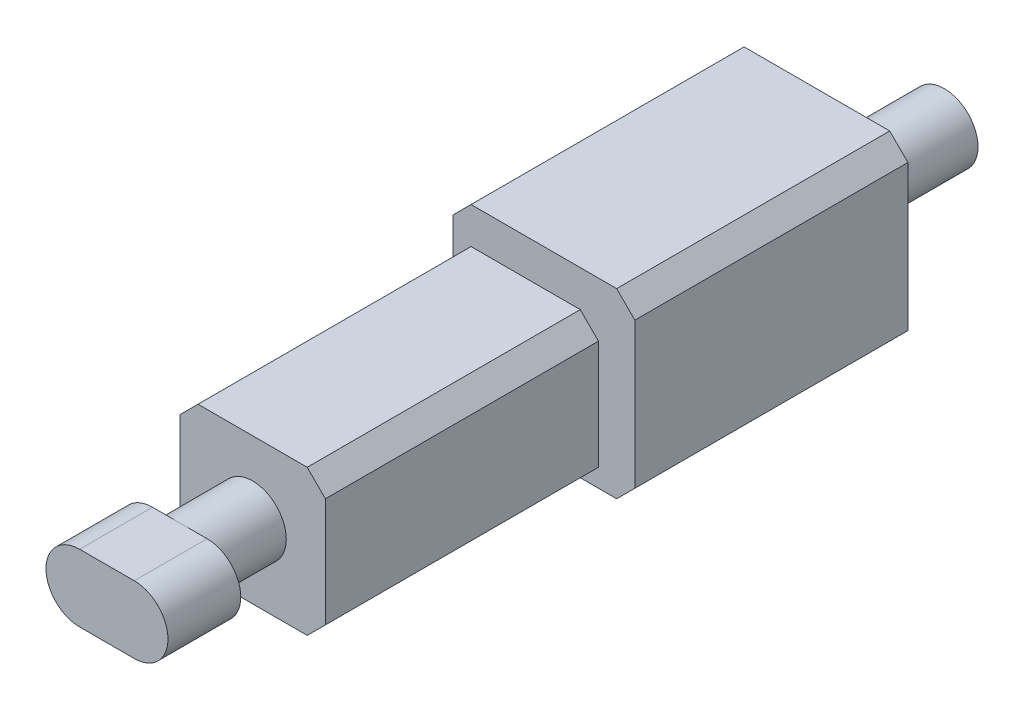
ISO-10303-21;
HEADER;
FILE_DESCRIPTION(('STEP AP214'),'2;1');
FILE_NAME('part.step','',(''),(''),'','','');
FILE_SCHEMA(('AUTOMOTIVE_DESIGN { 1 0 10303 214 1 1 1 1 }'));
ENDSEC;
DATA;
#1=APPLICATION_CONTEXT('core data for automotive mechanical design processes');
#2=APPLICATION_PROTOCOL_DEFINITION('international standard','automotive_design',2000,#1);
#3=PRODUCT_CONTEXT('',#1,'mechanical');
#4=PRODUCT('Part','Part','',(#3));
#5=PRODUCT_RELATED_PRODUCT_CATEGORY('part','',(#4));
#6=PRODUCT_DEFINITION_FORMATION('','',#4);
#7=PRODUCT_DEFINITION_CONTEXT('part definition',#1,'design');
#8=PRODUCT_DEFINITION('design','',#6,#7);
#9=PRODUCT_DEFINITION_SHAPE('','',#8);
#10=(LENGTH_UNIT() NAMED_UNIT(*) SI_UNIT(.MILLI.,.METRE.));
#11=(NAMED_UNIT(*) PLANE_ANGLE_UNIT() SI_UNIT($,.RADIAN.));
#12=(NAMED_UNIT(*) SI_UNIT($,.STERADIAN.) SOLID_ANGLE_UNIT());
#13=UNCERTAINTY_MEASURE_WITH_UNIT(LENGTH_MEASURE(1.E-05),#10,'distance_accuracy_value','');
#14=(GEOMETRIC_REPRESENTATION_CONTEXT(3) GLOBAL_UNCERTAINTY_ASSIGNED_CONTEXT((#13)) GLOBAL_UNIT_ASSIGNED_CONTEXT((#10,
#11,#12)) REPRESENTATION_CONTEXT('',''));
#15=CARTESIAN_POINT('',(0.,0.,0.));
#16=DIRECTION('',(0.,0.,1.));
#17=DIRECTION('',(1.,0.,0.));
#18=AXIS2_PLACEMENT_3D('',#15,#16,#17);
#19=CARTESIAN_POINT('',(2.,4.,7.5));
#20=DIRECTION('',(-1.,0.,0.));
#21=DIRECTION('',(0.,0.,1.));
#22=AXIS2_PLACEMENT_3D('',#19,#20,#21);
#23=PLANE('',#22);
#24=DIRECTION('',(0.,-1.,0.));
#25=VECTOR('',#24,1.);
#26=CARTESIAN_POINT('',(2.,4.,7.5));
#27=LINE('',#26,#25);
#28=CARTESIAN_POINT('',(2.,3.5,7.5));
#29=VERTEX_POINT('',#28);
#30=CARTESIAN_POINT('',(2.,0.5,7.5));
#31=VERTEX_POINT('',#30);
#32=EDGE_CURVE('E217',#29,#31,#27,.T.);
#33=ORIENTED_EDGE('',*,*,#32,.T.);
#34=DIRECTION('',(0.,0.,-1.));
#35=VECTOR('',#34,1.);
#36=CARTESIAN_POINT('',(2.,0.5,0.));
#37=LINE('',#36,#35);
#38=CARTESIAN_POINT('',(2.,0.5,0.));
#39=VERTEX_POINT('',#38);
#40=EDGE_CURVE('E281',#31,#39,#37,.T.);
#41=ORIENTED_EDGE('',*,*,#40,.T.);
#42=DIRECTION('',(0.,-1.,0.));
#43=VECTOR('',#42,1.);
#44=CARTESIAN_POINT('',(2.,4.,0.));
#45=LINE('',#44,#43);
#46=CARTESIAN_POINT('',(2.,3.5,0.));
#47=VERTEX_POINT('',#46);
#48=EDGE_CURVE('E293',#47,#39,#45,.T.);
#49=ORIENTED_EDGE('',*,*,#48,.F.);
#50=DIRECTION('',(0.,0.,1.));
#51=VECTOR('',#50,1.);
#52=CARTESIAN_POINT('',(2.,3.5,7.5));
#53=LINE('',#52,#51);
#54=EDGE_CURVE('E279',#47,#29,#53,.T.);
#55=ORIENTED_EDGE('',*,*,#54,.T.);
#56=EDGE_LOOP('',(#33,#41,#49,#55));
#57=FACE_BOUND('',#56,.T.);
#58=ADVANCED_FACE('F39',(#57),#23,.F.);
#59=CARTESIAN_POINT('',(0.,4.,0.));
#60=DIRECTION('',(0.,-1.,0.));
#61=DIRECTION('',(0.,0.,-1.));
#62=AXIS2_PLACEMENT_3D('',#59,#60,#61);
#63=PLANE('',#62);
#64=DIRECTION('',(1.,0.,0.));
#65=VECTOR('',#64,1.);
#66=CARTESIAN_POINT('',(0.,4.,0.));
#67=LINE('',#66,#65);
#68=CARTESIAN_POINT('',(-1.5,4.,0.));
#69=VERTEX_POINT('',#68);
#70=CARTESIAN_POINT('',(1.5,4.,0.));
#71=VERTEX_POINT('',#70);
#72=EDGE_CURVE('E339',#69,#71,#67,.T.);
#73=ORIENTED_EDGE('',*,*,#72,.F.);
#74=DIRECTION('',(0.,0.,1.));
#75=VECTOR('',#74,1.);
#76=CARTESIAN_POINT('',(-1.5,4.,0.));
#77=LINE('',#76,#75);
#78=CARTESIAN_POINT('',(-1.5,4.,7.5));
#79=VERTEX_POINT('',#78);
#80=EDGE_CURVE('E277',#69,#79,#77,.T.);
#81=ORIENTED_EDGE('',*,*,#80,.T.);
#82=DIRECTION('',(1.,0.,0.));
#83=VECTOR('',#82,1.);
#84=CARTESIAN_POINT('',(-2.,4.,7.5));
#85=LINE('',#84,#83);
#86=CARTESIAN_POINT('',(1.5,4.,7.5));
#87=VERTEX_POINT('',#86);
#88=EDGE_CURVE('E215',#79,#87,#85,.T.);
#89=ORIENTED_EDGE('',*,*,#88,.T.);
#90=DIRECTION('',(0.,0.,-1.));
#91=VECTOR('',#90,1.);
#92=CARTESIAN_POINT('',(1.5,4.,0.));
#93=LINE('',#92,#91);
#94=EDGE_CURVE('E274',#87,#71,#93,.T.);
#95=ORIENTED_EDGE('',*,*,#94,.T.);
#96=EDGE_LOOP('',(#73,#81,#89,#95));
#97=FACE_BOUND('',#96,.T.);
#98=ADVANCED_FACE('F379',(#97),#63,.F.);
#99=CARTESIAN_POINT('',(-2.,4.,-7.5));
#100=DIRECTION('',(0.,0.,1.));
#101=DIRECTION('',(1.,0.,0.));
#102=AXIS2_PLACEMENT_3D('',#99,#100,#101);
#103=PLANE('',#102);
#104=CARTESIAN_POINT('',(1.,2.83290341310044,-7.5));
#105=DIRECTION('',(0.,0.,1.));
#106=DIRECTION('',(1.,0.,0.));
#107=AXIS2_PLACEMENT_3D('',#104,#105,#106);
#108=CIRCLE('',#107,0.925);
#109=CARTESIAN_POINT('',(1.925,2.83290341310044,-7.5));
#110=VERTEX_POINT('',#109);
#111=EDGE_CURVE('E435',#110,#110,#108,.T.);
#112=ORIENTED_EDGE('',*,*,#111,.T.);
#113=EDGE_LOOP('',(#112));
#114=FACE_BOUND('',#113,.T.);
#115=DIRECTION('',(0.,1.,0.));
#116=VECTOR('',#115,1.);
#117=CARTESIAN_POINT('',(3.,0.,-7.5));
#118=LINE('',#117,#116);
#119=CARTESIAN_POINT('',(3.,0.5,-7.5));
#120=VERTEX_POINT('',#119);
#121=CARTESIAN_POINT('',(3.,4.5,-7.5));
#122=VERTEX_POINT('',#121);
#123=EDGE_CURVE('E331',#120,#122,#118,.T.);
#124=ORIENTED_EDGE('',*,*,#123,.F.);
#125=DIRECTION('',(0.707106781186545,0.70710678118655,0.));
#126=VECTOR('',#125,1.);
#127=CARTESIAN_POINT('',(2.5,0.,-7.5));
#128=LINE('',#127,#126);
#129=CARTESIAN_POINT('',(2.5,0.,-7.5));
#130=VERTEX_POINT('',#129);
#131=EDGE_CURVE('E253',#120,#130,#128,.F.);
#132=ORIENTED_EDGE('',*,*,#131,.T.);
#133=DIRECTION('',(-1.,0.,0.));
#134=VECTOR('',#133,1.);
#135=CARTESIAN_POINT('',(-2.,0.,-7.5));
#136=LINE('',#135,#134);
#137=CARTESIAN_POINT('',(-1.5,0.,-7.5));
#138=VERTEX_POINT('',#137);
#139=EDGE_CURVE('E209',#130,#138,#136,.T.);
#140=ORIENTED_EDGE('',*,*,#139,.T.);
#141=DIRECTION('',(-0.70710678118655,0.707106781186545,0.));
#142=VECTOR('',#141,1.);
#143=CARTESIAN_POINT('',(-2.,0.5,-7.5));
#144=LINE('',#143,#142);
#145=CARTESIAN_POINT('',(-2.,0.5,-7.5));
#146=VERTEX_POINT('',#145);
#147=EDGE_CURVE('E247',#138,#146,#144,.T.);
#148=ORIENTED_EDGE('',*,*,#147,.T.);
#149=DIRECTION('',(0.,-1.,0.));
#150=VECTOR('',#149,1.);
#151=CARTESIAN_POINT('',(-2.,4.,-7.5));
#152=LINE('',#151,#150);
#153=CARTESIAN_POINT('',(-2.,4.5,-7.5));
#154=VERTEX_POINT('',#153);
#155=EDGE_CURVE('E214',#154,#146,#152,.T.);
#156=ORIENTED_EDGE('',*,*,#155,.F.);
#157=DIRECTION('',(0.707106781186545,0.70710678118655,0.));
#158=VECTOR('',#157,1.);
#159=CARTESIAN_POINT('',(-1.5,5.,-7.5));
#160=LINE('',#159,#158);
#161=CARTESIAN_POINT('',(-1.5,5.,-7.5));
#162=VERTEX_POINT('',#161);
#163=EDGE_CURVE('E249',#154,#162,#160,.T.);
#164=ORIENTED_EDGE('',*,*,#163,.T.);
#165=DIRECTION('',(-1.,0.,0.));
#166=VECTOR('',#165,1.);
#167=CARTESIAN_POINT('',(-2.,5.,-7.5));
#168=LINE('',#167,#166);
#169=CARTESIAN_POINT('',(2.5,5.,-7.5));
#170=VERTEX_POINT('',#169);
#171=EDGE_CURVE('E329',#170,#162,#168,.T.);
#172=ORIENTED_EDGE('',*,*,#171,.F.);
#173=DIRECTION('',(-0.70710678118655,0.707106781186545,0.));
#174=VECTOR('',#173,1.);
#175=CARTESIAN_POINT('',(3.,4.5,-7.5));
#176=LINE('',#175,#174);
#177=EDGE_CURVE('E251',#170,#122,#176,.F.);
#178=ORIENTED_EDGE('',*,*,#177,.T.);
#179=EDGE_LOOP('',(#124,#132,#140,#148,#156,#164,#172,#178));
#180=FACE_BOUND('',#179,.T.);
#181=ADVANCED_FACE('F317',(#114,#180),#103,.F.);
#182=CARTESIAN_POINT('',(-2.,4.,7.5));
#183=DIRECTION('',(1.,0.,0.));
#184=DIRECTION('',(0.,0.,-1.));
#185=AXIS2_PLACEMENT_3D('',#182,#183,#184);
#186=PLANE('',#185);
#187=DIRECTION('',(0.,-1.,0.));
#188=VECTOR('',#187,1.);
#189=CARTESIAN_POINT('',(-2.,0.,0.));
#190=LINE('',#189,#188);
#191=CARTESIAN_POINT('',(-2.,4.5,0.));
#192=VERTEX_POINT('',#191);
#193=CARTESIAN_POINT('',(-2.,3.5,0.));
#194=VERTEX_POINT('',#193);
#195=EDGE_CURVE('E434',#192,#194,#190,.T.);
#196=ORIENTED_EDGE('',*,*,#195,.F.);
#197=DIRECTION('',(0.,0.,-1.));
#198=VECTOR('',#197,1.);
#199=CARTESIAN_POINT('',(-2.,4.5,-7.5));
#200=LINE('',#199,#198);
#201=EDGE_CURVE('E266',#192,#154,#200,.T.);
#202=ORIENTED_EDGE('',*,*,#201,.T.);
#203=ORIENTED_EDGE('',*,*,#155,.T.);
#204=DIRECTION('',(0.,0.,1.));
#205=VECTOR('',#204,1.);
#206=CARTESIAN_POINT('',(-2.,0.5,7.5));
#207=LINE('',#206,#205);
#208=CARTESIAN_POINT('',(-2.,0.5,7.5));
#209=VERTEX_POINT('',#208);
#210=EDGE_CURVE('E263',#146,#209,#207,.T.);
#211=ORIENTED_EDGE('',*,*,#210,.T.);
#212=DIRECTION('',(0.,-1.,0.));
#213=VECTOR('',#212,1.);
#214=CARTESIAN_POINT('',(-2.,4.,7.5));
#215=LINE('',#214,#213);
#216=CARTESIAN_POINT('',(-2.,3.5,7.5));
#217=VERTEX_POINT('',#216);
#218=EDGE_CURVE('E225',#217,#209,#215,.T.);
#219=ORIENTED_EDGE('',*,*,#218,.F.);
#220=DIRECTION('',(0.,0.,-1.));
#221=VECTOR('',#220,1.);
#222=CARTESIAN_POINT('',(-2.,3.5,7.5));
#223=LINE('',#222,#221);
#224=EDGE_CURVE('E260',#217,#194,#223,.T.);
#225=ORIENTED_EDGE('',*,*,#224,.T.);
#226=EDGE_LOOP('',(#196,#202,#203,#211,#219,#225));
#227=FACE_BOUND('',#226,.T.);
#228=ADVANCED_FACE('F311',(#227),#186,.F.);
#229=CARTESIAN_POINT('',(-2.,4.,7.5));
#230=DIRECTION('',(0.,0.,-1.));
#231=DIRECTION('',(-1.,0.,0.));
#232=AXIS2_PLACEMENT_3D('',#229,#230,#231);
#233=PLANE('',#232);
#234=CARTESIAN_POINT('',(0.,2.,7.5));
#235=DIRECTION('',(0.,0.,1.));
#236=DIRECTION('',(1.,0.,0.));
#237=AXIS2_PLACEMENT_3D('',#234,#235,#236);
#238=CIRCLE('',#237,0.925);
#239=CARTESIAN_POINT('',(0.925,2.,7.5));
#240=VERTEX_POINT('',#239);
#241=EDGE_CURVE('E210',#240,#240,#238,.T.);
#242=ORIENTED_EDGE('',*,*,#241,.F.);
#243=EDGE_LOOP('',(#242));
#244=FACE_BOUND('',#243,.T.);
#245=ORIENTED_EDGE('',*,*,#218,.T.);
#246=DIRECTION('',(0.70710678118655,-0.707106781186545,0.));
#247=VECTOR('',#246,1.);
#248=CARTESIAN_POINT('',(-2.,0.5,7.5));
#249=LINE('',#248,#247);
#250=CARTESIAN_POINT('',(-1.5,0.,7.5));
#251=VERTEX_POINT('',#250);
#252=EDGE_CURVE('E272',#209,#251,#249,.T.);
#253=ORIENTED_EDGE('',*,*,#252,.T.);
#254=DIRECTION('',(1.,0.,0.));
#255=VECTOR('',#254,1.);
#256=CARTESIAN_POINT('',(-2.,0.,7.5));
#257=LINE('',#256,#255);
#258=CARTESIAN_POINT('',(1.5,0.,7.5));
#259=VERTEX_POINT('',#258);
#260=EDGE_CURVE('E218',#251,#259,#257,.T.);
#261=ORIENTED_EDGE('',*,*,#260,.T.);
#262=DIRECTION('',(0.70710678118655,0.707106781186545,0.));
#263=VECTOR('',#262,1.);
#264=CARTESIAN_POINT('',(2.,0.5,7.5));
#265=LINE('',#264,#263);
#266=EDGE_CURVE('E269',#259,#31,#265,.T.);
#267=ORIENTED_EDGE('',*,*,#266,.T.);
#268=ORIENTED_EDGE('',*,*,#32,.F.);
#269=DIRECTION('',(0.707106781186545,-0.70710678118655,0.));
#270=VECTOR('',#269,1.);
#271=CARTESIAN_POINT('',(1.5,4.,7.5));
#272=LINE('',#271,#270);
#273=EDGE_CURVE('E55',#29,#87,#272,.F.);
#274=ORIENTED_EDGE('',*,*,#273,.T.);
#275=ORIENTED_EDGE('',*,*,#88,.F.);
#276=DIRECTION('',(0.707106781186545,0.70710678118655,0.));
#277=VECTOR('',#276,1.);
#278=CARTESIAN_POINT('',(-1.5,4.,7.5));
#279=LINE('',#278,#277);
#280=EDGE_CURVE('E63',#79,#217,#279,.F.);
#281=ORIENTED_EDGE('',*,*,#280,.T.);
#282=EDGE_LOOP('',(#245,#253,#261,#267,#268,#274,#275,#281));
#283=FACE_BOUND('',#282,.T.);
#284=ADVANCED_FACE('F303',(#244,#283),#233,.F.);
#285=CARTESIAN_POINT('',(0.,0.,0.));
#286=DIRECTION('',(0.,-1.,0.));
#287=DIRECTION('',(0.,0.,-1.));
#288=AXIS2_PLACEMENT_3D('',#285,#286,#287);
#289=PLANE('',#288);
#290=ORIENTED_EDGE('',*,*,#139,.F.);
#291=DIRECTION('',(0.,0.,1.));
#292=VECTOR('',#291,1.);
#293=CARTESIAN_POINT('',(2.5,0.,0.));
#294=LINE('',#293,#292);
#295=CARTESIAN_POINT('',(2.5,0.,0.));
#296=VERTEX_POINT('',#295);
#297=EDGE_CURVE('E233',#130,#296,#294,.T.);
#298=ORIENTED_EDGE('',*,*,#297,.T.);
#299=DIRECTION('',(1.,0.,0.));
#300=VECTOR('',#299,1.);
#301=CARTESIAN_POINT('',(-2.,0.,0.));
#302=LINE('',#301,#300);
#303=CARTESIAN_POINT('',(1.5,0.,0.));
#304=VERTEX_POINT('',#303);
#305=EDGE_CURVE('E291',#304,#296,#302,.T.);
#306=ORIENTED_EDGE('',*,*,#305,.F.);
#307=DIRECTION('',(0.,0.,1.));
#308=VECTOR('',#307,1.);
#309=CARTESIAN_POINT('',(1.5,0.,7.5));
#310=LINE('',#309,#308);
#311=EDGE_CURVE('E213',#304,#259,#310,.T.);
#312=ORIENTED_EDGE('',*,*,#311,.T.);
#313=ORIENTED_EDGE('',*,*,#260,.F.);
#314=DIRECTION('',(0.,0.,-1.));
#315=VECTOR('',#314,1.);
#316=CARTESIAN_POINT('',(-1.5,0.,-7.5));
#317=LINE('',#316,#315);
#318=EDGE_CURVE('E231',#251,#138,#317,.T.);
#319=ORIENTED_EDGE('',*,*,#318,.T.);
#320=EDGE_LOOP('',(#290,#298,#306,#312,#313,#319));
#321=FACE_BOUND('',#320,.T.);
#322=ADVANCED_FACE('F301',(#321),#289,.T.);
#323=CARTESIAN_POINT('',(0.,2.,9.5));
#324=DIRECTION('',(0.,0.,-1.));
#325=DIRECTION('',(-1.,0.,0.));
#326=AXIS2_PLACEMENT_3D('',#323,#324,#325);
#327=CYLINDRICAL_SURFACE('',#326,0.925);
#328=CARTESIAN_POINT('',(0.,2.,9.5));
#329=DIRECTION('',(0.,0.,1.));
#330=DIRECTION('',(1.,0.,0.));
#331=AXIS2_PLACEMENT_3D('',#328,#329,#330);
#332=CIRCLE('',#331,0.925);
#333=CARTESIAN_POINT('',(0.,2.925,9.5));
#334=VERTEX_POINT('',#333);
#335=CARTESIAN_POINT('',(0.,1.075,9.5));
#336=VERTEX_POINT('',#335);
#337=EDGE_CURVE('E202',#334,#336,#332,.T.);
#338=ORIENTED_EDGE('',*,*,#337,.F.);
#339=EDGE_CURVE('E199',#336,#334,#332,.T.);
#340=ORIENTED_EDGE('',*,*,#339,.F.);
#341=EDGE_LOOP('',(#338,#340));
#342=FACE_BOUND('',#341,.T.);
#343=ORIENTED_EDGE('',*,*,#241,.T.);
#344=EDGE_LOOP('',(#343));
#345=FACE_BOUND('',#344,.T.);
#346=ADVANCED_FACE('F466',(#342,#345),#327,.T.);
#347=CARTESIAN_POINT('',(-0.75,2.,9.5));
#348=DIRECTION('',(0.,0.,1.));
#349=DIRECTION('',(1.,0.,0.));
#350=AXIS2_PLACEMENT_3D('',#347,#348,#349);
#351=PLANE('',#350);
#352=DIRECTION('',(-1.,0.,0.));
#353=VECTOR('',#352,1.);
#354=CARTESIAN_POINT('',(-0.75,2.925,9.5));
#355=LINE('',#354,#353);
#356=CARTESIAN_POINT('',(-0.75,2.925,9.5));
#357=VERTEX_POINT('',#356);
#358=EDGE_CURVE('E352',#334,#357,#355,.T.);
#359=ORIENTED_EDGE('',*,*,#358,.F.);
#360=ORIENTED_EDGE('',*,*,#337,.T.);
#361=DIRECTION('',(1.,0.,0.));
#362=VECTOR('',#361,1.);
#363=CARTESIAN_POINT('',(-0.75,1.075,9.5));
#364=LINE('',#363,#362);
#365=CARTESIAN_POINT('',(-0.75,1.075,9.5));
#366=VERTEX_POINT('',#365);
#367=EDGE_CURVE('E348',#366,#336,#364,.T.);
#368=ORIENTED_EDGE('',*,*,#367,.F.);
#369=CARTESIAN_POINT('',(-0.75,2.,9.5));
#370=DIRECTION('',(0.,0.,1.));
#371=DIRECTION('',(1.,0.,0.));
#372=AXIS2_PLACEMENT_3D('',#369,#370,#371);
#373=CIRCLE('',#372,0.925);
#374=EDGE_CURVE('E198',#357,#366,#373,.T.);
#375=ORIENTED_EDGE('',*,*,#374,.F.);
#376=EDGE_LOOP('',(#359,#360,#368,#375));
#377=FACE_BOUND('',#376,.T.);
#378=ADVANCED_FACE('F368',(#377),#351,.F.);
#379=CARTESIAN_POINT('',(0.75,1.075,9.5));
#380=VERTEX_POINT('',#379);
#381=EDGE_CURVE('E347',#336,#380,#364,.T.);
#382=ORIENTED_EDGE('',*,*,#381,.F.);
#383=ORIENTED_EDGE('',*,*,#339,.T.);
#384=CARTESIAN_POINT('',(0.75,2.925,9.5));
#385=VERTEX_POINT('',#384);
#386=EDGE_CURVE('E194',#385,#334,#355,.T.);
#387=ORIENTED_EDGE('',*,*,#386,.F.);
#388=CARTESIAN_POINT('',(0.75,2.,9.5));
#389=DIRECTION('',(0.,0.,1.));
#390=DIRECTION('',(1.,0.,0.));
#391=AXIS2_PLACEMENT_3D('',#388,#389,#390);
#392=CIRCLE('',#391,0.925);
#393=EDGE_CURVE('E350',#380,#385,#392,.T.);
#394=ORIENTED_EDGE('',*,*,#393,.F.);
#395=EDGE_LOOP('',(#382,#383,#387,#394));
#396=FACE_BOUND('',#395,.T.);
#397=ADVANCED_FACE('F364',(#396),#351,.F.);
#398=CARTESIAN_POINT('',(-0.75,2.,11.5));
#399=DIRECTION('',(0.,0.,-1.));
#400=DIRECTION('',(-1.,0.,0.));
#401=AXIS2_PLACEMENT_3D('',#398,#399,#400);
#402=CYLINDRICAL_SURFACE('',#401,0.925);
#403=ORIENTED_EDGE('',*,*,#374,.T.);
#404=DIRECTION('',(0.,0.,-1.));
#405=VECTOR('',#404,1.);
#406=CARTESIAN_POINT('',(-0.75,1.075,11.5));
#407=LINE('',#406,#405);
#408=CARTESIAN_POINT('',(-0.75,1.075,11.5));
#409=VERTEX_POINT('',#408);
#410=EDGE_CURVE('E178',#409,#366,#407,.T.);
#411=ORIENTED_EDGE('',*,*,#410,.F.);
#412=CARTESIAN_POINT('',(-0.75,2.,11.5));
#413=DIRECTION('',(0.,0.,1.));
#414=DIRECTION('',(1.,0.,0.));
#415=AXIS2_PLACEMENT_3D('',#412,#413,#414);
#416=CIRCLE('',#415,0.925);
#417=CARTESIAN_POINT('',(-0.75,2.925,11.5));
#418=VERTEX_POINT('',#417);
#419=EDGE_CURVE('E185',#418,#409,#416,.T.);
#420=ORIENTED_EDGE('',*,*,#419,.F.);
#421=DIRECTION('',(0.,0.,-1.));
#422=VECTOR('',#421,1.);
#423=CARTESIAN_POINT('',(-0.75,2.925,11.5));
#424=LINE('',#423,#422);
#425=EDGE_CURVE('E345',#418,#357,#424,.T.);
#426=ORIENTED_EDGE('',*,*,#425,.T.);
#427=EDGE_LOOP('',(#403,#411,#420,#426));
#428=FACE_BOUND('',#427,.T.);
#429=ADVANCED_FACE('F196',(#428),#402,.T.);
#430=CARTESIAN_POINT('',(-0.75,1.075,11.5));
#431=DIRECTION('',(0.,1.,0.));
#432=DIRECTION('',(-1.,0.,0.));
#433=AXIS2_PLACEMENT_3D('',#430,#431,#432);
#434=PLANE('',#433);
#435=ORIENTED_EDGE('',*,*,#367,.T.);
#436=ORIENTED_EDGE('',*,*,#381,.T.);
#437=DIRECTION('',(0.,0.,-1.));
#438=VECTOR('',#437,1.);
#439=CARTESIAN_POINT('',(0.75,1.075,11.5));
#440=LINE('',#439,#438);
#441=CARTESIAN_POINT('',(0.75,1.075,11.5));
#442=VERTEX_POINT('',#441);
#443=EDGE_CURVE('E181',#442,#380,#440,.T.);
#444=ORIENTED_EDGE('',*,*,#443,.F.);
#445=DIRECTION('',(1.,0.,0.));
#446=VECTOR('',#445,1.);
#447=CARTESIAN_POINT('',(-0.75,1.075,11.5));
#448=LINE('',#447,#446);
#449=EDGE_CURVE('E173',#409,#442,#448,.T.);
#450=ORIENTED_EDGE('',*,*,#449,.F.);
#451=ORIENTED_EDGE('',*,*,#410,.T.);
#452=EDGE_LOOP('',(#435,#436,#444,#450,#451));
#453=FACE_BOUND('',#452,.T.);
#454=ADVANCED_FACE('F176',(#453),#434,.F.);
#455=CARTESIAN_POINT('',(0.75,2.,11.5));
#456=DIRECTION('',(0.,0.,-1.));
#457=DIRECTION('',(-1.,0.,0.));
#458=AXIS2_PLACEMENT_3D('',#455,#456,#457);
#459=CYLINDRICAL_SURFACE('',#458,0.925);
#460=ORIENTED_EDGE('',*,*,#393,.T.);
#461=DIRECTION('',(0.,0.,-1.));
#462=VECTOR('',#461,1.);
#463=CARTESIAN_POINT('',(0.75,2.925,11.5));
#464=LINE('',#463,#462);
#465=CARTESIAN_POINT('',(0.75,2.925,11.5));
#466=VERTEX_POINT('',#465);
#467=EDGE_CURVE('E204',#466,#385,#464,.T.);
#468=ORIENTED_EDGE('',*,*,#467,.F.);
#469=CARTESIAN_POINT('',(0.75,2.,11.5));
#470=DIRECTION('',(0.,0.,1.));
#471=DIRECTION('',(1.,0.,0.));
#472=AXIS2_PLACEMENT_3D('',#469,#470,#471);
#473=CIRCLE('',#472,0.925);
#474=EDGE_CURVE('E184',#442,#466,#473,.T.);
#475=ORIENTED_EDGE('',*,*,#474,.F.);
#476=ORIENTED_EDGE('',*,*,#443,.T.);
#477=EDGE_LOOP('',(#460,#468,#475,#476));
#478=FACE_BOUND('',#477,.T.);
#479=ADVANCED_FACE('F369',(#478),#459,.T.);
#480=CARTESIAN_POINT('',(-0.75,2.925,11.5));
#481=DIRECTION('',(0.,-1.,0.));
#482=DIRECTION('',(1.,0.,0.));
#483=AXIS2_PLACEMENT_3D('',#480,#481,#482);
#484=PLANE('',#483);
#485=ORIENTED_EDGE('',*,*,#386,.T.);
#486=ORIENTED_EDGE('',*,*,#358,.T.);
#487=ORIENTED_EDGE('',*,*,#425,.F.);
#488=DIRECTION('',(-1.,0.,0.));
#489=VECTOR('',#488,1.);
#490=CARTESIAN_POINT('',(-0.75,2.925,11.5));
#491=LINE('',#490,#489);
#492=EDGE_CURVE('E190',#466,#418,#491,.T.);
#493=ORIENTED_EDGE('',*,*,#492,.F.);
#494=ORIENTED_EDGE('',*,*,#467,.T.);
#495=EDGE_LOOP('',(#485,#486,#487,#493,#494));
#496=FACE_BOUND('',#495,.T.);
#497=ADVANCED_FACE('F359',(#496),#484,.F.);
#498=CARTESIAN_POINT('',(-0.75,2.,11.5));
#499=DIRECTION('',(0.,0.,1.));
#500=DIRECTION('',(1.,0.,0.));
#501=AXIS2_PLACEMENT_3D('',#498,#499,#500);
#502=PLANE('',#501);
#503=ORIENTED_EDGE('',*,*,#419,.T.);
#504=ORIENTED_EDGE('',*,*,#449,.T.);
#505=ORIENTED_EDGE('',*,*,#474,.T.);
#506=ORIENTED_EDGE('',*,*,#492,.T.);
#507=EDGE_LOOP('',(#503,#504,#505,#506));
#508=FACE_BOUND('',#507,.T.);
#509=ADVANCED_FACE('F188',(#508),#502,.T.);
#510=CARTESIAN_POINT('',(0.,0.,0.));
#511=DIRECTION('',(0.,0.,-1.));
#512=DIRECTION('',(-1.,0.,0.));
#513=AXIS2_PLACEMENT_3D('',#510,#511,#512);
#514=PLANE('',#513);
#515=ORIENTED_EDGE('',*,*,#305,.T.);
#516=DIRECTION('',(-0.707106781186545,-0.70710678118655,0.));
#517=VECTOR('',#516,1.);
#518=CARTESIAN_POINT('',(2.5,0.,0.));
#519=LINE('',#518,#517);
#520=CARTESIAN_POINT('',(3.,0.5,0.));
#521=VERTEX_POINT('',#520);
#522=EDGE_CURVE('E240',#296,#521,#519,.F.);
#523=ORIENTED_EDGE('',*,*,#522,.T.);
#524=DIRECTION('',(0.,1.,0.));
#525=VECTOR('',#524,1.);
#526=CARTESIAN_POINT('',(3.,0.,0.));
#527=LINE('',#526,#525);
#528=CARTESIAN_POINT('',(3.,4.5,0.));
#529=VERTEX_POINT('',#528);
#530=EDGE_CURVE('E332',#521,#529,#527,.T.);
#531=ORIENTED_EDGE('',*,*,#530,.T.);
#532=DIRECTION('',(0.70710678118655,-0.707106781186545,0.));
#533=VECTOR('',#532,1.);
#534=CARTESIAN_POINT('',(3.,4.5,0.));
#535=LINE('',#534,#533);
#536=CARTESIAN_POINT('',(2.5,5.,0.));
#537=VERTEX_POINT('',#536);
#538=EDGE_CURVE('E238',#529,#537,#535,.F.);
#539=ORIENTED_EDGE('',*,*,#538,.T.);
#540=DIRECTION('',(-1.,0.,0.));
#541=VECTOR('',#540,1.);
#542=CARTESIAN_POINT('',(-2.,5.,0.));
#543=LINE('',#542,#541);
#544=CARTESIAN_POINT('',(-1.5,5.,0.));
#545=VERTEX_POINT('',#544);
#546=EDGE_CURVE('E327',#537,#545,#543,.T.);
#547=ORIENTED_EDGE('',*,*,#546,.T.);
#548=DIRECTION('',(-0.707106781186545,-0.70710678118655,0.));
#549=VECTOR('',#548,1.);
#550=CARTESIAN_POINT('',(-1.5,5.,0.));
#551=LINE('',#550,#549);
#552=EDGE_CURVE('E236',#545,#192,#551,.T.);
#553=ORIENTED_EDGE('',*,*,#552,.T.);
#554=ORIENTED_EDGE('',*,*,#195,.T.);
#555=DIRECTION('',(-0.707106781186545,-0.70710678118655,0.));
#556=VECTOR('',#555,1.);
#557=CARTESIAN_POINT('',(-2.75,2.74999999999999,0.));
#558=LINE('',#557,#556);
#559=EDGE_CURVE('E284',#194,#69,#558,.F.);
#560=ORIENTED_EDGE('',*,*,#559,.T.);
#561=ORIENTED_EDGE('',*,*,#72,.T.);
#562=DIRECTION('',(-0.707106781186545,0.70710678118655,0.));
#563=VECTOR('',#562,1.);
#564=CARTESIAN_POINT('',(2.75,2.74999999999999,0.));
#565=LINE('',#564,#563);
#566=EDGE_CURVE('E11',#71,#47,#565,.F.);
#567=ORIENTED_EDGE('',*,*,#566,.T.);
#568=ORIENTED_EDGE('',*,*,#48,.T.);
#569=DIRECTION('',(-0.70710678118655,-0.707106781186545,0.));
#570=VECTOR('',#569,1.);
#571=CARTESIAN_POINT('',(0.749999999999993,-0.749999999999998,0.));
#572=LINE('',#571,#570);
#573=EDGE_CURVE('E48',#39,#304,#572,.T.);
#574=ORIENTED_EDGE('',*,*,#573,.T.);
#575=EDGE_LOOP('',(#515,#523,#531,#539,#547,#553,#554,#560,#561,#567,#568,#574));
#576=FACE_BOUND('',#575,.T.);
#577=ADVANCED_FACE('F290',(#576),#514,.F.);
#578=CARTESIAN_POINT('',(-2.,5.,-7.5));
#579=DIRECTION('',(0.,1.,0.));
#580=DIRECTION('',(0.,0.,1.));
#581=AXIS2_PLACEMENT_3D('',#578,#579,#580);
#582=PLANE('',#581);
#583=ORIENTED_EDGE('',*,*,#546,.F.);
#584=DIRECTION('',(0.,0.,-1.));
#585=VECTOR('',#584,1.);
#586=CARTESIAN_POINT('',(2.5,5.,-7.5));
#587=LINE('',#586,#585);
#588=EDGE_CURVE('E258',#537,#170,#587,.T.);
#589=ORIENTED_EDGE('',*,*,#588,.T.);
#590=ORIENTED_EDGE('',*,*,#171,.T.);
#591=DIRECTION('',(0.,0.,1.));
#592=VECTOR('',#591,1.);
#593=CARTESIAN_POINT('',(-1.5,5.,0.));
#594=LINE('',#593,#592);
#595=EDGE_CURVE('E255',#162,#545,#594,.T.);
#596=ORIENTED_EDGE('',*,*,#595,.T.);
#597=EDGE_LOOP('',(#583,#589,#590,#596));
#598=FACE_BOUND('',#597,.T.);
#599=ADVANCED_FACE('F326',(#598),#582,.T.);
#600=CARTESIAN_POINT('',(3.,0.,-7.5));
#601=DIRECTION('',(1.,0.,0.));
#602=DIRECTION('',(0.,0.,-1.));
#603=AXIS2_PLACEMENT_3D('',#600,#601,#602);
#604=PLANE('',#603);
#605=ORIENTED_EDGE('',*,*,#530,.F.);
#606=DIRECTION('',(0.,0.,-1.));
#607=VECTOR('',#606,1.);
#608=CARTESIAN_POINT('',(3.,0.5,-7.5));
#609=LINE('',#608,#607);
#610=EDGE_CURVE('E245',#521,#120,#609,.T.);
#611=ORIENTED_EDGE('',*,*,#610,.T.);
#612=ORIENTED_EDGE('',*,*,#123,.T.);
#613=DIRECTION('',(0.,0.,1.));
#614=VECTOR('',#613,1.);
#615=CARTESIAN_POINT('',(3.,4.5,-7.5));
#616=LINE('',#615,#614);
#617=EDGE_CURVE('E242',#122,#529,#616,.T.);
#618=ORIENTED_EDGE('',*,*,#617,.T.);
#619=EDGE_LOOP('',(#605,#611,#612,#618));
#620=FACE_BOUND('',#619,.T.);
#621=ADVANCED_FACE('F453',(#620),#604,.T.);
#622=CARTESIAN_POINT('',(1.,2.83290341310044,-10.5));
#623=DIRECTION('',(0.,0.,1.));
#624=DIRECTION('',(1.,0.,0.));
#625=AXIS2_PLACEMENT_3D('',#622,#623,#624);
#626=CYLINDRICAL_SURFACE('',#625,0.925);
#627=CARTESIAN_POINT('',(1.,2.83290341310044,-10.5));
#628=DIRECTION('',(0.,0.,1.));
#629=DIRECTION('',(1.,0.,0.));
#630=AXIS2_PLACEMENT_3D('',#627,#628,#629);
#631=CIRCLE('',#630,0.925);
#632=CARTESIAN_POINT('',(1.925,2.83290341310044,-10.5));
#633=VERTEX_POINT('',#632);
#634=EDGE_CURVE('E438',#633,#633,#631,.T.);
#635=ORIENTED_EDGE('',*,*,#634,.T.);
#636=EDGE_LOOP('',(#635));
#637=FACE_BOUND('',#636,.T.);
#638=ORIENTED_EDGE('',*,*,#111,.F.);
#639=EDGE_LOOP('',(#638));
#640=FACE_BOUND('',#639,.T.);
#641=ADVANCED_FACE('F445',(#637,#640),#626,.T.);
#642=CARTESIAN_POINT('',(1.,2.83290341310044,-10.5));
#643=DIRECTION('',(0.,0.,1.));
#644=DIRECTION('',(1.,0.,0.));
#645=AXIS2_PLACEMENT_3D('',#642,#643,#644);
#646=PLANE('',#645);
#647=ORIENTED_EDGE('',*,*,#634,.F.);
#648=EDGE_LOOP('',(#647));
#649=FACE_BOUND('',#648,.T.);
#650=ADVANCED_FACE('F398',(#649),#646,.F.);
#651=CARTESIAN_POINT('',(2.5,0.,0.));
#652=DIRECTION('',(-0.70710678118655,0.707106781186545,0.));
#653=DIRECTION('',(0.,0.,1.));
#654=AXIS2_PLACEMENT_3D('',#651,#652,#653);
#655=PLANE('',#654);
#656=ORIENTED_EDGE('',*,*,#131,.F.);
#657=ORIENTED_EDGE('',*,*,#610,.F.);
#658=ORIENTED_EDGE('',*,*,#522,.F.);
#659=ORIENTED_EDGE('',*,*,#297,.F.);
#660=EDGE_LOOP('',(#656,#657,#658,#659));
#661=FACE_BOUND('',#660,.T.);
#662=ADVANCED_FACE('F391',(#661),#655,.F.);
#663=CARTESIAN_POINT('',(3.,4.5,-7.5));
#664=DIRECTION('',(-0.707106781186545,-0.70710678118655,0.));
#665=DIRECTION('',(0.,0.,1.));
#666=AXIS2_PLACEMENT_3D('',#663,#664,#665);
#667=PLANE('',#666);
#668=ORIENTED_EDGE('',*,*,#177,.F.);
#669=ORIENTED_EDGE('',*,*,#588,.F.);
#670=ORIENTED_EDGE('',*,*,#538,.F.);
#671=ORIENTED_EDGE('',*,*,#617,.F.);
#672=EDGE_LOOP('',(#668,#669,#670,#671));
#673=FACE_BOUND('',#672,.T.);
#674=ADVANCED_FACE('F397',(#673),#667,.F.);
#675=CARTESIAN_POINT('',(-1.5,5.,-7.5));
#676=DIRECTION('',(-0.70710678118655,0.707106781186545,0.));
#677=DIRECTION('',(0.,0.,-1.));
#678=AXIS2_PLACEMENT_3D('',#675,#676,#677);
#679=PLANE('',#678);
#680=ORIENTED_EDGE('',*,*,#163,.F.);
#681=ORIENTED_EDGE('',*,*,#201,.F.);
#682=ORIENTED_EDGE('',*,*,#552,.F.);
#683=ORIENTED_EDGE('',*,*,#595,.F.);
#684=EDGE_LOOP('',(#680,#681,#682,#683));
#685=FACE_BOUND('',#684,.T.);
#686=ADVANCED_FACE('F322',(#685),#679,.T.);
#687=CARTESIAN_POINT('',(-2.,0.5,7.5));
#688=DIRECTION('',(-0.707106781186545,-0.70710678118655,0.));
#689=DIRECTION('',(0.,0.,-1.));
#690=AXIS2_PLACEMENT_3D('',#687,#688,#689);
#691=PLANE('',#690);
#692=ORIENTED_EDGE('',*,*,#147,.F.);
#693=ORIENTED_EDGE('',*,*,#318,.F.);
#694=ORIENTED_EDGE('',*,*,#252,.F.);
#695=ORIENTED_EDGE('',*,*,#210,.F.);
#696=EDGE_LOOP('',(#692,#693,#694,#695));
#697=FACE_BOUND('',#696,.T.);
#698=ADVANCED_FACE('F308',(#697),#691,.T.);
#699=CARTESIAN_POINT('',(-1.5,4.,0.));
#700=DIRECTION('',(0.70710678118655,-0.707106781186545,0.));
#701=DIRECTION('',(0.,0.,1.));
#702=AXIS2_PLACEMENT_3D('',#699,#700,#701);
#703=PLANE('',#702);
#704=ORIENTED_EDGE('',*,*,#559,.F.);
#705=ORIENTED_EDGE('',*,*,#224,.F.);
#706=ORIENTED_EDGE('',*,*,#280,.F.);
#707=ORIENTED_EDGE('',*,*,#80,.F.);
#708=EDGE_LOOP('',(#704,#705,#706,#707));
#709=FACE_BOUND('',#708,.T.);
#710=ADVANCED_FACE('F416',(#709),#703,.F.);
#711=CARTESIAN_POINT('',(2.,0.5,7.5));
#712=DIRECTION('',(0.707106781186545,-0.70710678118655,0.));
#713=DIRECTION('',(0.,0.,1.));
#714=AXIS2_PLACEMENT_3D('',#711,#712,#713);
#715=PLANE('',#714);
#716=ORIENTED_EDGE('',*,*,#266,.F.);
#717=ORIENTED_EDGE('',*,*,#311,.F.);
#718=ORIENTED_EDGE('',*,*,#573,.F.);
#719=ORIENTED_EDGE('',*,*,#40,.F.);
#720=EDGE_LOOP('',(#716,#717,#718,#719));
#721=FACE_BOUND('',#720,.T.);
#722=ADVANCED_FACE('F297',(#721),#715,.T.);
#723=CARTESIAN_POINT('',(1.5,4.,0.));
#724=DIRECTION('',(-0.70710678118655,-0.707106781186545,0.));
#725=DIRECTION('',(0.,0.,-1.));
#726=AXIS2_PLACEMENT_3D('',#723,#724,#725);
#727=PLANE('',#726);
#728=ORIENTED_EDGE('',*,*,#273,.F.);
#729=ORIENTED_EDGE('',*,*,#54,.F.);
#730=ORIENTED_EDGE('',*,*,#566,.F.);
#731=ORIENTED_EDGE('',*,*,#94,.F.);
#732=EDGE_LOOP('',(#728,#729,#730,#731));
#733=FACE_BOUND('',#732,.T.);
#734=ADVANCED_FACE('F42',(#733),#727,.F.);
#735=CLOSED_SHELL('',(#58,#98,#181,#228,#284,#322,#346,#378,#397,#429,#454,#479,#497,#509,#577,
#599,#621,#641,#650,#662,#674,#686,#698,#710,#722,#734));
#736=MANIFOLD_SOLID_BREP('B2',#735);
#737=ADVANCED_BREP_SHAPE_REPRESENTATION('',(#18,#736),#14);
#738=SHAPE_DEFINITION_REPRESENTATION(#9,#737);
ENDSEC;
END-ISO-10303-21;
